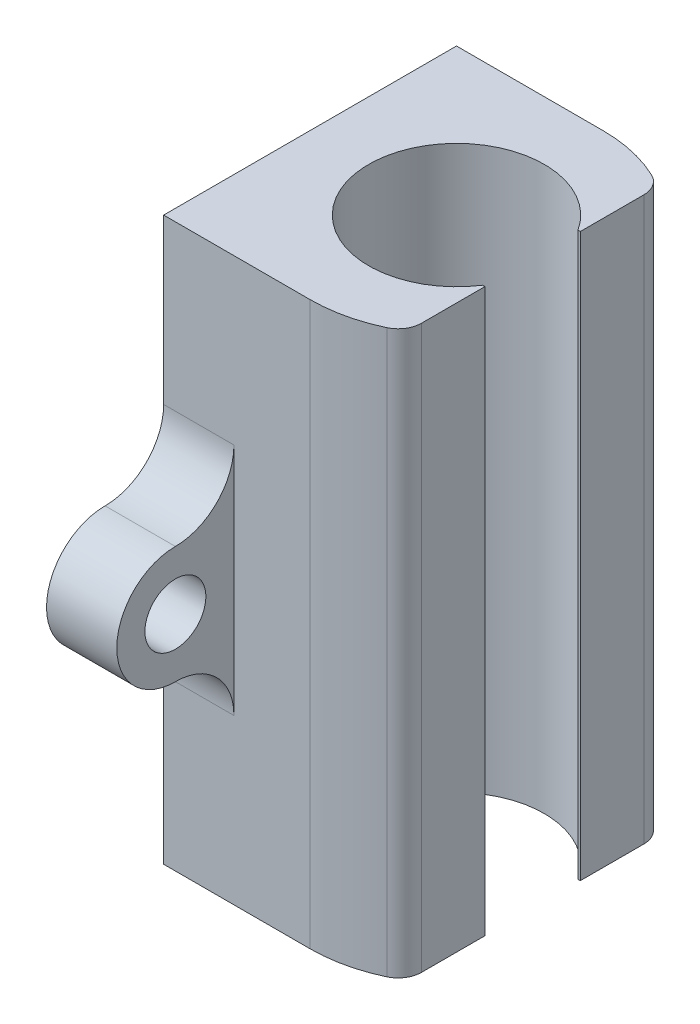
ISO-10303-21;
HEADER;
FILE_DESCRIPTION(('STEP AP214'),'2;1');
FILE_NAME('part.step','',(''),(''),'','','');
FILE_SCHEMA(('AUTOMOTIVE_DESIGN { 1 0 10303 214 1 1 1 1 }'));
ENDSEC;
DATA;
#1=APPLICATION_CONTEXT('core data for automotive mechanical design processes');
#2=APPLICATION_PROTOCOL_DEFINITION('international standard','automotive_design',2000,#1);
#3=PRODUCT_CONTEXT('',#1,'mechanical');
#4=PRODUCT('Part','Part','',(#3));
#5=PRODUCT_RELATED_PRODUCT_CATEGORY('part','',(#4));
#6=PRODUCT_DEFINITION_FORMATION('','',#4);
#7=PRODUCT_DEFINITION_CONTEXT('part definition',#1,'design');
#8=PRODUCT_DEFINITION('design','',#6,#7);
#9=PRODUCT_DEFINITION_SHAPE('','',#8);
#10=(LENGTH_UNIT() NAMED_UNIT(*) SI_UNIT(.MILLI.,.METRE.));
#11=(NAMED_UNIT(*) PLANE_ANGLE_UNIT() SI_UNIT($,.RADIAN.));
#12=(NAMED_UNIT(*) SI_UNIT($,.STERADIAN.) SOLID_ANGLE_UNIT());
#13=UNCERTAINTY_MEASURE_WITH_UNIT(LENGTH_MEASURE(1.E-05),#10,'distance_accuracy_value','');
#14=(GEOMETRIC_REPRESENTATION_CONTEXT(3) GLOBAL_UNCERTAINTY_ASSIGNED_CONTEXT((#13)) GLOBAL_UNIT_ASSIGNED_CONTEXT((#10,
#11,#12)) REPRESENTATION_CONTEXT('',''));
#15=CARTESIAN_POINT('',(0.,0.,0.));
#16=DIRECTION('',(0.,0.,1.));
#17=DIRECTION('',(1.,0.,0.));
#18=AXIS2_PLACEMENT_3D('',#15,#16,#17);
#19=CARTESIAN_POINT('',(0.,48.,0.));
#20=DIRECTION('',(0.,-1.,0.));
#21=DIRECTION('',(0.,0.,-1.));
#22=AXIS2_PLACEMENT_3D('',#19,#20,#21);
#23=CYLINDRICAL_SURFACE('',#22,12.5);
#24=CARTESIAN_POINT('',(0.,48.,0.));
#25=DIRECTION('',(0.,1.,0.));
#26=DIRECTION('',(0.,0.,1.));
#27=AXIS2_PLACEMENT_3D('',#24,#25,#26);
#28=CIRCLE('',#27,12.5);
#29=CARTESIAN_POINT('',(5.35714285714286,48.,-11.2938487863156));
#30=VERTEX_POINT('',#29);
#31=CARTESIAN_POINT('',(0.,48.,-12.5));
#32=VERTEX_POINT('',#31);
#33=EDGE_CURVE('E261',#30,#32,#28,.T.);
#34=ORIENTED_EDGE('',*,*,#33,.F.);
#35=DIRECTION('',(0.,-1.,0.));
#36=VECTOR('',#35,1.);
#37=CARTESIAN_POINT('',(5.35714285714286,48.,-11.2938487863156));
#38=LINE('',#37,#36);
#39=CARTESIAN_POINT('',(5.35714285714286,0.,-11.2938487863156));
#40=VERTEX_POINT('',#39);
#41=EDGE_CURVE('E330',#30,#40,#38,.T.);
#42=ORIENTED_EDGE('',*,*,#41,.T.);
#43=CARTESIAN_POINT('',(0.,0.,0.));
#44=DIRECTION('',(0.,1.,0.));
#45=DIRECTION('',(0.,0.,1.));
#46=AXIS2_PLACEMENT_3D('',#43,#44,#45);
#47=CIRCLE('',#46,12.5);
#48=CARTESIAN_POINT('',(0.,0.,-12.5));
#49=VERTEX_POINT('',#48);
#50=EDGE_CURVE('E255',#40,#49,#47,.T.);
#51=ORIENTED_EDGE('',*,*,#50,.T.);
#52=DIRECTION('',(0.,-1.,0.));
#53=VECTOR('',#52,1.);
#54=CARTESIAN_POINT('',(0.,48.,-12.5));
#55=LINE('',#54,#53);
#56=EDGE_CURVE('E289',#32,#49,#55,.T.);
#57=ORIENTED_EDGE('',*,*,#56,.F.);
#58=EDGE_LOOP('',(#34,#42,#51,#57));
#59=FACE_BOUND('',#58,.T.);
#60=ADVANCED_FACE('F32',(#59),#23,.T.);
#61=CARTESIAN_POINT('',(0.,48.,0.));
#62=DIRECTION('',(0.,1.,0.));
#63=DIRECTION('',(0.,0.,1.));
#64=AXIS2_PLACEMENT_3D('',#61,#62,#63);
#65=PLANE('',#64);
#66=DIRECTION('',(0.,0.,-1.));
#67=VECTOR('',#66,1.);
#68=CARTESIAN_POINT('',(6.5,48.,-4.06939798987516));
#69=LINE('',#68,#67);
#70=CARTESIAN_POINT('',(6.5,48.,-4.06939798987516));
#71=VERTEX_POINT('',#70);
#72=CARTESIAN_POINT('',(6.5,48.,-9.48683298050514));
#73=VERTEX_POINT('',#72);
#74=EDGE_CURVE('E190',#71,#73,#69,.T.);
#75=ORIENTED_EDGE('',*,*,#74,.T.);
#76=CARTESIAN_POINT('',(4.5,48.,-9.48683298050514));
#77=DIRECTION('',(0.,1.,0.));
#78=DIRECTION('',(0.,0.,1.));
#79=AXIS2_PLACEMENT_3D('',#76,#77,#78);
#80=CIRCLE('',#79,2.);
#81=EDGE_CURVE('E11',#73,#30,#80,.T.);
#82=ORIENTED_EDGE('',*,*,#81,.T.);
#83=ORIENTED_EDGE('',*,*,#33,.T.);
#84=DIRECTION('',(-1.,0.,0.));
#85=VECTOR('',#84,1.);
#86=CARTESIAN_POINT('',(0.,48.,-12.5));
#87=LINE('',#86,#85);
#88=CARTESIAN_POINT('',(-12.5,48.,-12.5));
#89=VERTEX_POINT('',#88);
#90=EDGE_CURVE('E260',#32,#89,#87,.T.);
#91=ORIENTED_EDGE('',*,*,#90,.T.);
#92=DIRECTION('',(0.,0.,1.));
#93=VECTOR('',#92,1.);
#94=CARTESIAN_POINT('',(-12.5,48.,-12.5));
#95=LINE('',#94,#93);
#96=CARTESIAN_POINT('',(-12.5,48.,12.5));
#97=VERTEX_POINT('',#96);
#98=EDGE_CURVE('E263',#89,#97,#95,.T.);
#99=ORIENTED_EDGE('',*,*,#98,.T.);
#100=DIRECTION('',(1.,0.,0.));
#101=VECTOR('',#100,1.);
#102=CARTESIAN_POINT('',(0.,48.,12.5));
#103=LINE('',#102,#101);
#104=CARTESIAN_POINT('',(0.,48.,12.5));
#105=VERTEX_POINT('',#104);
#106=EDGE_CURVE('E265',#97,#105,#103,.T.);
#107=ORIENTED_EDGE('',*,*,#106,.T.);
#108=CARTESIAN_POINT('',(5.35714285714286,48.,11.2938487863156));
#109=VERTEX_POINT('',#108);
#110=EDGE_CURVE('E258',#105,#109,#28,.T.);
#111=ORIENTED_EDGE('',*,*,#110,.T.);
#112=CARTESIAN_POINT('',(4.5,48.,9.48683298050514));
#113=DIRECTION('',(0.,1.,0.));
#114=DIRECTION('',(0.,0.,1.));
#115=AXIS2_PLACEMENT_3D('',#112,#113,#114);
#116=CIRCLE('',#115,2.);
#117=CARTESIAN_POINT('',(6.5,48.,9.48683298050514));
#118=VERTEX_POINT('',#117);
#119=EDGE_CURVE('E177',#109,#118,#116,.T.);
#120=ORIENTED_EDGE('',*,*,#119,.T.);
#121=DIRECTION('',(0.,0.,-1.));
#122=VECTOR('',#121,1.);
#123=CARTESIAN_POINT('',(6.5,48.,12.5));
#124=LINE('',#123,#122);
#125=CARTESIAN_POINT('',(6.5,48.,4.06939798987516));
#126=VERTEX_POINT('',#125);
#127=EDGE_CURVE('E169',#118,#126,#124,.T.);
#128=ORIENTED_EDGE('',*,*,#127,.T.);
#129=DIRECTION('',(-1.,0.,0.));
#130=VECTOR('',#129,1.);
#131=CARTESIAN_POINT('',(6.5,48.,4.06939798987516));
#132=LINE('',#131,#130);
#133=CARTESIAN_POINT('',(6.3,48.,4.06939798987516));
#134=VERTEX_POINT('',#133);
#135=EDGE_CURVE('E174',#126,#134,#132,.T.);
#136=ORIENTED_EDGE('',*,*,#135,.T.);
#137=CARTESIAN_POINT('',(0.,48.,0.));
#138=DIRECTION('',(0.,1.,0.));
#139=DIRECTION('',(0.,0.,1.));
#140=AXIS2_PLACEMENT_3D('',#137,#138,#139);
#141=CIRCLE('',#140,7.5);
#142=CARTESIAN_POINT('',(6.3,48.,-4.06939798987516));
#143=VERTEX_POINT('',#142);
#144=EDGE_CURVE('E253',#143,#134,#141,.T.);
#145=ORIENTED_EDGE('',*,*,#144,.F.);
#146=DIRECTION('',(1.,0.,0.));
#147=VECTOR('',#146,1.);
#148=CARTESIAN_POINT('',(6.5,48.,-4.06939798987516));
#149=LINE('',#148,#147);
#150=EDGE_CURVE('E194',#143,#71,#149,.T.);
#151=ORIENTED_EDGE('',*,*,#150,.T.);
#152=EDGE_LOOP('',(#75,#82,#83,#91,#99,#107,#111,#120,#128,#136,#145,#151));
#153=FACE_BOUND('',#152,.T.);
#154=ADVANCED_FACE('F171',(#153),#65,.T.);
#155=CARTESIAN_POINT('',(0.,0.,0.));
#156=DIRECTION('',(0.,1.,0.));
#157=DIRECTION('',(0.,0.,1.));
#158=AXIS2_PLACEMENT_3D('',#155,#156,#157);
#159=PLANE('',#158);
#160=ORIENTED_EDGE('',*,*,#50,.F.);
#161=CARTESIAN_POINT('',(4.5,0.,-9.48683298050514));
#162=DIRECTION('',(0.,1.,0.));
#163=DIRECTION('',(0.,0.,1.));
#164=AXIS2_PLACEMENT_3D('',#161,#162,#163);
#165=CIRCLE('',#164,2.);
#166=CARTESIAN_POINT('',(6.5,0.,-9.48683298050514));
#167=VERTEX_POINT('',#166);
#168=EDGE_CURVE('E54',#40,#167,#165,.F.);
#169=ORIENTED_EDGE('',*,*,#168,.T.);
#170=DIRECTION('',(0.,0.,-1.));
#171=VECTOR('',#170,1.);
#172=CARTESIAN_POINT('',(6.5,0.,-4.06939798987516));
#173=LINE('',#172,#171);
#174=CARTESIAN_POINT('',(6.5,0.,-4.06939798987516));
#175=VERTEX_POINT('',#174);
#176=EDGE_CURVE('E180',#175,#167,#173,.T.);
#177=ORIENTED_EDGE('',*,*,#176,.F.);
#178=DIRECTION('',(1.,0.,0.));
#179=VECTOR('',#178,1.);
#180=CARTESIAN_POINT('',(6.5,0.,-4.06939798987516));
#181=LINE('',#180,#179);
#182=CARTESIAN_POINT('',(6.3,0.,-4.06939798987516));
#183=VERTEX_POINT('',#182);
#184=EDGE_CURVE('E203',#183,#175,#181,.T.);
#185=ORIENTED_EDGE('',*,*,#184,.F.);
#186=CARTESIAN_POINT('',(0.,0.,0.));
#187=DIRECTION('',(0.,1.,0.));
#188=DIRECTION('',(0.,0.,1.));
#189=AXIS2_PLACEMENT_3D('',#186,#187,#188);
#190=CIRCLE('',#189,7.5);
#191=CARTESIAN_POINT('',(6.3,0.,4.06939798987516));
#192=VERTEX_POINT('',#191);
#193=EDGE_CURVE('E250',#183,#192,#190,.T.);
#194=ORIENTED_EDGE('',*,*,#193,.T.);
#195=DIRECTION('',(-1.,0.,0.));
#196=VECTOR('',#195,1.);
#197=CARTESIAN_POINT('',(6.5,0.,4.06939798987516));
#198=LINE('',#197,#196);
#199=CARTESIAN_POINT('',(6.5,0.,4.06939798987516));
#200=VERTEX_POINT('',#199);
#201=EDGE_CURVE('E201',#200,#192,#198,.T.);
#202=ORIENTED_EDGE('',*,*,#201,.F.);
#203=DIRECTION('',(0.,0.,-1.));
#204=VECTOR('',#203,1.);
#205=CARTESIAN_POINT('',(6.5,0.,12.5));
#206=LINE('',#205,#204);
#207=CARTESIAN_POINT('',(6.5,0.,9.48683298050514));
#208=VERTEX_POINT('',#207);
#209=EDGE_CURVE('E186',#208,#200,#206,.T.);
#210=ORIENTED_EDGE('',*,*,#209,.F.);
#211=CARTESIAN_POINT('',(4.5,0.,9.48683298050514));
#212=DIRECTION('',(0.,1.,0.));
#213=DIRECTION('',(0.,0.,1.));
#214=AXIS2_PLACEMENT_3D('',#211,#212,#213);
#215=CIRCLE('',#214,2.);
#216=CARTESIAN_POINT('',(5.35714285714286,0.,11.2938487863156));
#217=VERTEX_POINT('',#216);
#218=EDGE_CURVE('E328',#208,#217,#215,.F.);
#219=ORIENTED_EDGE('',*,*,#218,.T.);
#220=CARTESIAN_POINT('',(0.,0.,12.5));
#221=VERTEX_POINT('',#220);
#222=EDGE_CURVE('E268',#221,#217,#47,.T.);
#223=ORIENTED_EDGE('',*,*,#222,.F.);
#224=DIRECTION('',(1.,0.,0.));
#225=VECTOR('',#224,1.);
#226=CARTESIAN_POINT('',(0.,0.,12.5));
#227=LINE('',#226,#225);
#228=CARTESIAN_POINT('',(-12.5,0.,12.5));
#229=VERTEX_POINT('',#228);
#230=EDGE_CURVE('E277',#229,#221,#227,.T.);
#231=ORIENTED_EDGE('',*,*,#230,.F.);
#232=DIRECTION('',(0.,0.,1.));
#233=VECTOR('',#232,1.);
#234=CARTESIAN_POINT('',(-12.5,0.,-12.5));
#235=LINE('',#234,#233);
#236=CARTESIAN_POINT('',(-12.5,0.,-12.5));
#237=VERTEX_POINT('',#236);
#238=EDGE_CURVE('E274',#237,#229,#235,.T.);
#239=ORIENTED_EDGE('',*,*,#238,.F.);
#240=DIRECTION('',(-1.,0.,0.));
#241=VECTOR('',#240,1.);
#242=CARTESIAN_POINT('',(0.,0.,-12.5));
#243=LINE('',#242,#241);
#244=EDGE_CURVE('E271',#49,#237,#243,.T.);
#245=ORIENTED_EDGE('',*,*,#244,.F.);
#246=EDGE_LOOP('',(#160,#169,#177,#185,#194,#202,#210,#219,#223,#231,#239,#245));
#247=FACE_BOUND('',#246,.T.);
#248=ADVANCED_FACE('F340',(#247),#159,.F.);
#249=ORIENTED_EDGE('',*,*,#222,.T.);
#250=DIRECTION('',(0.,-1.,0.));
#251=VECTOR('',#250,1.);
#252=CARTESIAN_POINT('',(5.35714285714286,48.,11.2938487863156));
#253=LINE('',#252,#251);
#254=EDGE_CURVE('E322',#217,#109,#253,.F.);
#255=ORIENTED_EDGE('',*,*,#254,.T.);
#256=ORIENTED_EDGE('',*,*,#110,.F.);
#257=DIRECTION('',(0.,-1.,0.));
#258=VECTOR('',#257,1.);
#259=CARTESIAN_POINT('',(0.,48.,12.5));
#260=LINE('',#259,#258);
#261=EDGE_CURVE('E267',#105,#221,#260,.T.);
#262=ORIENTED_EDGE('',*,*,#261,.T.);
#263=EDGE_LOOP('',(#249,#255,#256,#262));
#264=FACE_BOUND('',#263,.T.);
#265=ADVANCED_FACE('F359',(#264),#23,.T.);
#266=CARTESIAN_POINT('',(0.,48.,-12.5));
#267=DIRECTION('',(0.,0.,1.));
#268=DIRECTION('',(1.,0.,0.));
#269=AXIS2_PLACEMENT_3D('',#266,#267,#268);
#270=PLANE('',#269);
#271=DIRECTION('',(0.,1.,0.));
#272=VECTOR('',#271,1.);
#273=CARTESIAN_POINT('',(-6.5,19.,-12.5));
#274=LINE('',#273,#272);
#275=CARTESIAN_POINT('',(-6.5,14.,-12.5));
#276=VERTEX_POINT('',#275);
#277=CARTESIAN_POINT('',(-6.5,34.,-12.5));
#278=VERTEX_POINT('',#277);
#279=EDGE_CURVE('E242',#276,#278,#274,.T.);
#280=ORIENTED_EDGE('',*,*,#279,.T.);
#281=DIRECTION('',(-1.,0.,0.));
#282=VECTOR('',#281,1.);
#283=CARTESIAN_POINT('',(0.,34.,-12.5));
#284=LINE('',#283,#282);
#285=CARTESIAN_POINT('',(-12.5,34.,-12.5));
#286=VERTEX_POINT('',#285);
#287=EDGE_CURVE('E305',#278,#286,#284,.T.);
#288=ORIENTED_EDGE('',*,*,#287,.T.);
#289=DIRECTION('',(0.,-1.,0.));
#290=VECTOR('',#289,1.);
#291=CARTESIAN_POINT('',(-12.5,48.,-12.5));
#292=LINE('',#291,#290);
#293=EDGE_CURVE('E286',#89,#286,#292,.T.);
#294=ORIENTED_EDGE('',*,*,#293,.F.);
#295=ORIENTED_EDGE('',*,*,#90,.F.);
#296=ORIENTED_EDGE('',*,*,#56,.T.);
#297=ORIENTED_EDGE('',*,*,#244,.T.);
#298=CARTESIAN_POINT('',(-12.5,14.,-12.5));
#299=VERTEX_POINT('',#298);
#300=EDGE_CURVE('E285',#299,#237,#292,.T.);
#301=ORIENTED_EDGE('',*,*,#300,.F.);
#302=DIRECTION('',(-1.,0.,0.));
#303=VECTOR('',#302,1.);
#304=CARTESIAN_POINT('',(0.,14.,-12.5));
#305=LINE('',#304,#303);
#306=EDGE_CURVE('E292',#299,#276,#305,.F.);
#307=ORIENTED_EDGE('',*,*,#306,.T.);
#308=EDGE_LOOP('',(#280,#288,#294,#295,#296,#297,#301,#307));
#309=FACE_BOUND('',#308,.T.);
#310=ADVANCED_FACE('F346',(#309),#270,.F.);
#311=CARTESIAN_POINT('',(-12.5,48.,-12.5));
#312=DIRECTION('',(1.,0.,0.));
#313=DIRECTION('',(0.,0.,-1.));
#314=AXIS2_PLACEMENT_3D('',#311,#312,#313);
#315=PLANE('',#314);
#316=CARTESIAN_POINT('',(-12.5,24.,17.5));
#317=DIRECTION('',(-1.,0.,0.));
#318=DIRECTION('',(0.,0.,1.));
#319=AXIS2_PLACEMENT_3D('',#316,#317,#318);
#320=CIRCLE('',#319,2.6);
#321=CARTESIAN_POINT('',(-12.5,24.,20.1));
#322=VERTEX_POINT('',#321);
#323=EDGE_CURVE('E209',#322,#322,#320,.T.);
#324=ORIENTED_EDGE('',*,*,#323,.F.);
#325=EDGE_LOOP('',(#324));
#326=FACE_BOUND('',#325,.T.);
#327=CARTESIAN_POINT('',(-12.5,24.,-17.5));
#328=DIRECTION('',(-1.,0.,0.));
#329=DIRECTION('',(0.,0.,1.));
#330=AXIS2_PLACEMENT_3D('',#327,#328,#329);
#331=CIRCLE('',#330,2.6);
#332=CARTESIAN_POINT('',(-12.5,24.,-14.9));
#333=VERTEX_POINT('',#332);
#334=EDGE_CURVE('E216',#333,#333,#331,.T.);
#335=ORIENTED_EDGE('',*,*,#334,.F.);
#336=EDGE_LOOP('',(#335));
#337=FACE_BOUND('',#336,.T.);
#338=ORIENTED_EDGE('',*,*,#238,.T.);
#339=DIRECTION('',(0.,-1.,0.));
#340=VECTOR('',#339,1.);
#341=CARTESIAN_POINT('',(-12.5,48.,12.5));
#342=LINE('',#341,#340);
#343=CARTESIAN_POINT('',(-12.5,14.,12.5));
#344=VERTEX_POINT('',#343);
#345=EDGE_CURVE('E281',#344,#229,#342,.T.);
#346=ORIENTED_EDGE('',*,*,#345,.F.);
#347=CARTESIAN_POINT('',(-12.5,14.,17.5));
#348=DIRECTION('',(1.,0.,0.));
#349=DIRECTION('',(0.,0.,-1.));
#350=AXIS2_PLACEMENT_3D('',#347,#348,#349);
#351=CIRCLE('',#350,5.);
#352=CARTESIAN_POINT('',(-12.5,19.,17.5));
#353=VERTEX_POINT('',#352);
#354=EDGE_CURVE('E308',#344,#353,#351,.T.);
#355=ORIENTED_EDGE('',*,*,#354,.T.);
#356=CARTESIAN_POINT('',(-12.5,24.,17.5));
#357=DIRECTION('',(-1.,0.,0.));
#358=DIRECTION('',(0.,0.,1.));
#359=AXIS2_PLACEMENT_3D('',#356,#357,#358);
#360=CIRCLE('',#359,5.);
#361=CARTESIAN_POINT('',(-12.5,29.,17.5));
#362=VERTEX_POINT('',#361);
#363=EDGE_CURVE('E222',#353,#362,#360,.T.);
#364=ORIENTED_EDGE('',*,*,#363,.T.);
#365=CARTESIAN_POINT('',(-12.5,34.,17.5));
#366=DIRECTION('',(1.,0.,0.));
#367=DIRECTION('',(0.,0.,-1.));
#368=AXIS2_PLACEMENT_3D('',#365,#366,#367);
#369=CIRCLE('',#368,5.);
#370=CARTESIAN_POINT('',(-12.5,34.,12.5));
#371=VERTEX_POINT('',#370);
#372=EDGE_CURVE('E313',#362,#371,#369,.T.);
#373=ORIENTED_EDGE('',*,*,#372,.T.);
#374=EDGE_CURVE('E282',#97,#371,#342,.T.);
#375=ORIENTED_EDGE('',*,*,#374,.F.);
#376=ORIENTED_EDGE('',*,*,#98,.F.);
#377=ORIENTED_EDGE('',*,*,#293,.T.);
#378=CARTESIAN_POINT('',(-12.5,34.,-17.5));
#379=DIRECTION('',(1.,0.,0.));
#380=DIRECTION('',(0.,0.,-1.));
#381=AXIS2_PLACEMENT_3D('',#378,#379,#380);
#382=CIRCLE('',#381,5.);
#383=CARTESIAN_POINT('',(-12.5,29.,-17.5));
#384=VERTEX_POINT('',#383);
#385=EDGE_CURVE('E317',#286,#384,#382,.T.);
#386=ORIENTED_EDGE('',*,*,#385,.T.);
#387=CARTESIAN_POINT('',(-12.5,24.,-17.5));
#388=DIRECTION('',(-1.,0.,0.));
#389=DIRECTION('',(0.,0.,1.));
#390=AXIS2_PLACEMENT_3D('',#387,#388,#389);
#391=CIRCLE('',#390,5.);
#392=CARTESIAN_POINT('',(-12.5,19.,-17.5));
#393=VERTEX_POINT('',#392);
#394=EDGE_CURVE('E236',#384,#393,#391,.T.);
#395=ORIENTED_EDGE('',*,*,#394,.T.);
#396=CARTESIAN_POINT('',(-12.5,14.,-17.5));
#397=DIRECTION('',(1.,0.,0.));
#398=DIRECTION('',(0.,0.,-1.));
#399=AXIS2_PLACEMENT_3D('',#396,#397,#398);
#400=CIRCLE('',#399,5.);
#401=EDGE_CURVE('E295',#393,#299,#400,.T.);
#402=ORIENTED_EDGE('',*,*,#401,.T.);
#403=ORIENTED_EDGE('',*,*,#300,.T.);
#404=EDGE_LOOP('',(#338,#346,#355,#364,#373,#375,#376,#377,#386,#395,#402,#403));
#405=FACE_BOUND('',#404,.T.);
#406=ADVANCED_FACE('F372',(#326,#337,#405),#315,.F.);
#407=CARTESIAN_POINT('',(0.,48.,12.5));
#408=DIRECTION('',(0.,0.,-1.));
#409=DIRECTION('',(-1.,0.,0.));
#410=AXIS2_PLACEMENT_3D('',#407,#408,#409);
#411=PLANE('',#410);
#412=DIRECTION('',(0.,-1.,0.));
#413=VECTOR('',#412,1.);
#414=CARTESIAN_POINT('',(-6.5,29.,12.5));
#415=LINE('',#414,#413);
#416=CARTESIAN_POINT('',(-6.5,34.,12.5));
#417=VERTEX_POINT('',#416);
#418=CARTESIAN_POINT('',(-6.5,14.,12.5));
#419=VERTEX_POINT('',#418);
#420=EDGE_CURVE('E228',#417,#419,#415,.T.);
#421=ORIENTED_EDGE('',*,*,#420,.T.);
#422=DIRECTION('',(-1.,0.,0.));
#423=VECTOR('',#422,1.);
#424=CARTESIAN_POINT('',(0.,14.,12.5));
#425=LINE('',#424,#423);
#426=EDGE_CURVE('E302',#419,#344,#425,.T.);
#427=ORIENTED_EDGE('',*,*,#426,.T.);
#428=ORIENTED_EDGE('',*,*,#345,.T.);
#429=ORIENTED_EDGE('',*,*,#230,.T.);
#430=ORIENTED_EDGE('',*,*,#261,.F.);
#431=ORIENTED_EDGE('',*,*,#106,.F.);
#432=ORIENTED_EDGE('',*,*,#374,.T.);
#433=DIRECTION('',(-1.,0.,0.));
#434=VECTOR('',#433,1.);
#435=CARTESIAN_POINT('',(0.,34.,12.5));
#436=LINE('',#435,#434);
#437=EDGE_CURVE('E299',#371,#417,#436,.F.);
#438=ORIENTED_EDGE('',*,*,#437,.T.);
#439=EDGE_LOOP('',(#421,#427,#428,#429,#430,#431,#432,#438));
#440=FACE_BOUND('',#439,.T.);
#441=ADVANCED_FACE('F424',(#440),#411,.F.);
#442=CARTESIAN_POINT('',(0.,48.,0.));
#443=DIRECTION('',(0.,-1.,0.));
#444=DIRECTION('',(0.,0.,-1.));
#445=AXIS2_PLACEMENT_3D('',#442,#443,#444);
#446=CYLINDRICAL_SURFACE('',#445,7.5);
#447=DIRECTION('',(0.,-1.,0.));
#448=VECTOR('',#447,1.);
#449=CARTESIAN_POINT('',(6.3,48.,-4.06939798987516));
#450=LINE('',#449,#448);
#451=EDGE_CURVE('E210',#143,#183,#450,.T.);
#452=ORIENTED_EDGE('',*,*,#451,.F.);
#453=ORIENTED_EDGE('',*,*,#144,.T.);
#454=DIRECTION('',(0.,-1.,0.));
#455=VECTOR('',#454,1.);
#456=CARTESIAN_POINT('',(6.3,48.,4.06939798987516));
#457=LINE('',#456,#455);
#458=EDGE_CURVE('E189',#134,#192,#457,.T.);
#459=ORIENTED_EDGE('',*,*,#458,.T.);
#460=ORIENTED_EDGE('',*,*,#193,.F.);
#461=EDGE_LOOP('',(#452,#453,#459,#460));
#462=FACE_BOUND('',#461,.T.);
#463=ADVANCED_FACE('F383',(#462),#446,.F.);
#464=CARTESIAN_POINT('',(-6.5,24.,-17.5));
#465=DIRECTION('',(-1.,0.,0.));
#466=DIRECTION('',(0.,0.,1.));
#467=AXIS2_PLACEMENT_3D('',#464,#465,#466);
#468=CYLINDRICAL_SURFACE('',#467,5.);
#469=ORIENTED_EDGE('',*,*,#394,.F.);
#470=DIRECTION('',(-1.,0.,0.));
#471=VECTOR('',#470,1.);
#472=CARTESIAN_POINT('',(-6.5,29.,-17.5));
#473=LINE('',#472,#471);
#474=CARTESIAN_POINT('',(-6.5,29.,-17.5));
#475=VERTEX_POINT('',#474);
#476=EDGE_CURVE('E247',#475,#384,#473,.T.);
#477=ORIENTED_EDGE('',*,*,#476,.F.);
#478=CARTESIAN_POINT('',(-6.5,24.,-17.5));
#479=DIRECTION('',(-1.,0.,0.));
#480=DIRECTION('',(0.,0.,1.));
#481=AXIS2_PLACEMENT_3D('',#478,#479,#480);
#482=CIRCLE('',#481,5.);
#483=CARTESIAN_POINT('',(-6.5,19.,-17.5));
#484=VERTEX_POINT('',#483);
#485=EDGE_CURVE('E239',#475,#484,#482,.T.);
#486=ORIENTED_EDGE('',*,*,#485,.T.);
#487=DIRECTION('',(-1.,0.,0.));
#488=VECTOR('',#487,1.);
#489=CARTESIAN_POINT('',(-6.5,19.,-17.5));
#490=LINE('',#489,#488);
#491=EDGE_CURVE('E244',#484,#393,#490,.T.);
#492=ORIENTED_EDGE('',*,*,#491,.T.);
#493=EDGE_LOOP('',(#469,#477,#486,#492));
#494=FACE_BOUND('',#493,.T.);
#495=ADVANCED_FACE('F418',(#494),#468,.T.);
#496=CARTESIAN_POINT('',(-6.5,24.,-17.5));
#497=DIRECTION('',(-1.,0.,0.));
#498=DIRECTION('',(0.,0.,1.));
#499=AXIS2_PLACEMENT_3D('',#496,#497,#498);
#500=PLANE('',#499);
#501=CARTESIAN_POINT('',(-6.5,24.,-17.5));
#502=DIRECTION('',(-1.,0.,0.));
#503=DIRECTION('',(0.,0.,1.));
#504=AXIS2_PLACEMENT_3D('',#501,#502,#503);
#505=CIRCLE('',#504,2.6);
#506=CARTESIAN_POINT('',(-6.5,24.,-14.9));
#507=VERTEX_POINT('',#506);
#508=EDGE_CURVE('E219',#507,#507,#505,.T.);
#509=ORIENTED_EDGE('',*,*,#508,.T.);
#510=EDGE_LOOP('',(#509));
#511=FACE_BOUND('',#510,.T.);
#512=ORIENTED_EDGE('',*,*,#485,.F.);
#513=CARTESIAN_POINT('',(-6.5,34.,-17.5));
#514=DIRECTION('',(-1.,0.,0.));
#515=DIRECTION('',(0.,0.,1.));
#516=AXIS2_PLACEMENT_3D('',#513,#514,#515);
#517=CIRCLE('',#516,5.);
#518=EDGE_CURVE('E319',#475,#278,#517,.T.);
#519=ORIENTED_EDGE('',*,*,#518,.T.);
#520=ORIENTED_EDGE('',*,*,#279,.F.);
#521=CARTESIAN_POINT('',(-6.5,14.,-17.5));
#522=DIRECTION('',(-1.,0.,0.));
#523=DIRECTION('',(0.,0.,1.));
#524=AXIS2_PLACEMENT_3D('',#521,#522,#523);
#525=CIRCLE('',#524,5.);
#526=EDGE_CURVE('E297',#276,#484,#525,.T.);
#527=ORIENTED_EDGE('',*,*,#526,.T.);
#528=EDGE_LOOP('',(#512,#519,#520,#527));
#529=FACE_BOUND('',#528,.T.);
#530=ADVANCED_FACE('F414',(#511,#529),#500,.F.);
#531=CARTESIAN_POINT('',(-6.5,24.,17.5));
#532=DIRECTION('',(-1.,0.,0.));
#533=DIRECTION('',(0.,0.,1.));
#534=AXIS2_PLACEMENT_3D('',#531,#532,#533);
#535=CYLINDRICAL_SURFACE('',#534,5.);
#536=ORIENTED_EDGE('',*,*,#363,.F.);
#537=DIRECTION('',(-1.,0.,0.));
#538=VECTOR('',#537,1.);
#539=CARTESIAN_POINT('',(-6.5,19.,17.5));
#540=LINE('',#539,#538);
#541=CARTESIAN_POINT('',(-6.5,19.,17.5));
#542=VERTEX_POINT('',#541);
#543=EDGE_CURVE('E233',#542,#353,#540,.T.);
#544=ORIENTED_EDGE('',*,*,#543,.F.);
#545=CARTESIAN_POINT('',(-6.5,24.,17.5));
#546=DIRECTION('',(-1.,0.,0.));
#547=DIRECTION('',(0.,0.,1.));
#548=AXIS2_PLACEMENT_3D('',#545,#546,#547);
#549=CIRCLE('',#548,5.);
#550=CARTESIAN_POINT('',(-6.5,29.,17.5));
#551=VERTEX_POINT('',#550);
#552=EDGE_CURVE('E225',#542,#551,#549,.T.);
#553=ORIENTED_EDGE('',*,*,#552,.T.);
#554=DIRECTION('',(-1.,0.,0.));
#555=VECTOR('',#554,1.);
#556=CARTESIAN_POINT('',(-6.5,29.,17.5));
#557=LINE('',#556,#555);
#558=EDGE_CURVE('E230',#551,#362,#557,.T.);
#559=ORIENTED_EDGE('',*,*,#558,.T.);
#560=EDGE_LOOP('',(#536,#544,#553,#559));
#561=FACE_BOUND('',#560,.T.);
#562=ADVANCED_FACE('F410',(#561),#535,.T.);
#563=CARTESIAN_POINT('',(-6.5,24.,17.5));
#564=DIRECTION('',(-1.,0.,0.));
#565=DIRECTION('',(0.,0.,1.));
#566=AXIS2_PLACEMENT_3D('',#563,#564,#565);
#567=PLANE('',#566);
#568=CARTESIAN_POINT('',(-6.5,24.,17.5));
#569=DIRECTION('',(-1.,0.,0.));
#570=DIRECTION('',(0.,0.,1.));
#571=AXIS2_PLACEMENT_3D('',#568,#569,#570);
#572=CIRCLE('',#571,2.6);
#573=CARTESIAN_POINT('',(-6.5,24.,20.1));
#574=VERTEX_POINT('',#573);
#575=EDGE_CURVE('E213',#574,#574,#572,.T.);
#576=ORIENTED_EDGE('',*,*,#575,.T.);
#577=EDGE_LOOP('',(#576));
#578=FACE_BOUND('',#577,.T.);
#579=ORIENTED_EDGE('',*,*,#552,.F.);
#580=CARTESIAN_POINT('',(-6.5,14.,17.5));
#581=DIRECTION('',(-1.,0.,0.));
#582=DIRECTION('',(0.,0.,1.));
#583=AXIS2_PLACEMENT_3D('',#580,#581,#582);
#584=CIRCLE('',#583,5.);
#585=EDGE_CURVE('E310',#542,#419,#584,.T.);
#586=ORIENTED_EDGE('',*,*,#585,.T.);
#587=ORIENTED_EDGE('',*,*,#420,.F.);
#588=CARTESIAN_POINT('',(-6.5,34.,17.5));
#589=DIRECTION('',(-1.,0.,0.));
#590=DIRECTION('',(0.,0.,1.));
#591=AXIS2_PLACEMENT_3D('',#588,#589,#590);
#592=CIRCLE('',#591,5.);
#593=EDGE_CURVE('E315',#417,#551,#592,.T.);
#594=ORIENTED_EDGE('',*,*,#593,.T.);
#595=EDGE_LOOP('',(#579,#586,#587,#594));
#596=FACE_BOUND('',#595,.T.);
#597=ADVANCED_FACE('F406',(#578,#596),#567,.F.);
#598=CARTESIAN_POINT('',(-6.5,24.,-17.5));
#599=DIRECTION('',(-1.,0.,0.));
#600=DIRECTION('',(0.,0.,1.));
#601=AXIS2_PLACEMENT_3D('',#598,#599,#600);
#602=CYLINDRICAL_SURFACE('',#601,2.6);
#603=ORIENTED_EDGE('',*,*,#508,.F.);
#604=EDGE_LOOP('',(#603));
#605=FACE_BOUND('',#604,.T.);
#606=ORIENTED_EDGE('',*,*,#334,.T.);
#607=EDGE_LOOP('',(#606));
#608=FACE_BOUND('',#607,.T.);
#609=ADVANCED_FACE('F402',(#605,#608),#602,.F.);
#610=CARTESIAN_POINT('',(-6.5,24.,17.5));
#611=DIRECTION('',(-1.,0.,0.));
#612=DIRECTION('',(0.,0.,1.));
#613=AXIS2_PLACEMENT_3D('',#610,#611,#612);
#614=CYLINDRICAL_SURFACE('',#613,2.6);
#615=ORIENTED_EDGE('',*,*,#575,.F.);
#616=EDGE_LOOP('',(#615));
#617=FACE_BOUND('',#616,.T.);
#618=ORIENTED_EDGE('',*,*,#323,.T.);
#619=EDGE_LOOP('',(#618));
#620=FACE_BOUND('',#619,.T.);
#621=ADVANCED_FACE('F398',(#617,#620),#614,.F.);
#622=CARTESIAN_POINT('',(-6.5,14.,-17.5));
#623=DIRECTION('',(-1.,0.,0.));
#624=DIRECTION('',(0.,0.,1.));
#625=AXIS2_PLACEMENT_3D('',#622,#623,#624);
#626=CYLINDRICAL_SURFACE('',#625,5.);
#627=ORIENTED_EDGE('',*,*,#526,.F.);
#628=ORIENTED_EDGE('',*,*,#306,.F.);
#629=ORIENTED_EDGE('',*,*,#401,.F.);
#630=ORIENTED_EDGE('',*,*,#491,.F.);
#631=EDGE_LOOP('',(#627,#628,#629,#630));
#632=FACE_BOUND('',#631,.T.);
#633=ADVANCED_FACE('F401',(#632),#626,.F.);
#634=CARTESIAN_POINT('',(0.,14.,17.5));
#635=DIRECTION('',(-1.,0.,0.));
#636=DIRECTION('',(0.,0.,1.));
#637=AXIS2_PLACEMENT_3D('',#634,#635,#636);
#638=CYLINDRICAL_SURFACE('',#637,5.);
#639=ORIENTED_EDGE('',*,*,#585,.F.);
#640=ORIENTED_EDGE('',*,*,#543,.T.);
#641=ORIENTED_EDGE('',*,*,#354,.F.);
#642=ORIENTED_EDGE('',*,*,#426,.F.);
#643=EDGE_LOOP('',(#639,#640,#641,#642));
#644=FACE_BOUND('',#643,.T.);
#645=ADVANCED_FACE('F442',(#644),#638,.F.);
#646=CARTESIAN_POINT('',(-6.5,34.,17.5));
#647=DIRECTION('',(-1.,0.,0.));
#648=DIRECTION('',(0.,0.,1.));
#649=AXIS2_PLACEMENT_3D('',#646,#647,#648);
#650=CYLINDRICAL_SURFACE('',#649,5.);
#651=ORIENTED_EDGE('',*,*,#593,.F.);
#652=ORIENTED_EDGE('',*,*,#437,.F.);
#653=ORIENTED_EDGE('',*,*,#372,.F.);
#654=ORIENTED_EDGE('',*,*,#558,.F.);
#655=EDGE_LOOP('',(#651,#652,#653,#654));
#656=FACE_BOUND('',#655,.T.);
#657=ADVANCED_FACE('F448',(#656),#650,.F.);
#658=CARTESIAN_POINT('',(0.,34.,-17.5));
#659=DIRECTION('',(-1.,0.,0.));
#660=DIRECTION('',(0.,0.,1.));
#661=AXIS2_PLACEMENT_3D('',#658,#659,#660);
#662=CYLINDRICAL_SURFACE('',#661,5.);
#663=ORIENTED_EDGE('',*,*,#518,.F.);
#664=ORIENTED_EDGE('',*,*,#476,.T.);
#665=ORIENTED_EDGE('',*,*,#385,.F.);
#666=ORIENTED_EDGE('',*,*,#287,.F.);
#667=EDGE_LOOP('',(#663,#664,#665,#666));
#668=FACE_BOUND('',#667,.T.);
#669=ADVANCED_FACE('F396',(#668),#662,.F.);
#670=CARTESIAN_POINT('',(6.5,48.,4.06939798987516));
#671=DIRECTION('',(0.,0.,1.));
#672=DIRECTION('',(1.,0.,0.));
#673=AXIS2_PLACEMENT_3D('',#670,#671,#672);
#674=PLANE('',#673);
#675=ORIENTED_EDGE('',*,*,#201,.T.);
#676=ORIENTED_EDGE('',*,*,#458,.F.);
#677=ORIENTED_EDGE('',*,*,#135,.F.);
#678=DIRECTION('',(0.,-1.,0.));
#679=VECTOR('',#678,1.);
#680=CARTESIAN_POINT('',(6.5,48.,4.06939798987516));
#681=LINE('',#680,#679);
#682=EDGE_CURVE('E183',#126,#200,#681,.T.);
#683=ORIENTED_EDGE('',*,*,#682,.T.);
#684=EDGE_LOOP('',(#675,#676,#677,#683));
#685=FACE_BOUND('',#684,.T.);
#686=ADVANCED_FACE('F192',(#685),#674,.F.);
#687=CARTESIAN_POINT('',(6.5,48.,12.5));
#688=DIRECTION('',(-1.,0.,0.));
#689=DIRECTION('',(0.,0.,1.));
#690=AXIS2_PLACEMENT_3D('',#687,#688,#689);
#691=PLANE('',#690);
#692=ORIENTED_EDGE('',*,*,#127,.F.);
#693=DIRECTION('',(0.,-1.,0.));
#694=VECTOR('',#693,1.);
#695=CARTESIAN_POINT('',(6.5,48.,9.48683298050514));
#696=LINE('',#695,#694);
#697=EDGE_CURVE('E326',#118,#208,#696,.T.);
#698=ORIENTED_EDGE('',*,*,#697,.T.);
#699=ORIENTED_EDGE('',*,*,#209,.T.);
#700=ORIENTED_EDGE('',*,*,#682,.F.);
#701=EDGE_LOOP('',(#692,#698,#699,#700));
#702=FACE_BOUND('',#701,.T.);
#703=ADVANCED_FACE('F184',(#702),#691,.F.);
#704=CARTESIAN_POINT('',(6.5,48.,-4.06939798987516));
#705=DIRECTION('',(-1.,0.,0.));
#706=DIRECTION('',(0.,0.,1.));
#707=AXIS2_PLACEMENT_3D('',#704,#705,#706);
#708=PLANE('',#707);
#709=ORIENTED_EDGE('',*,*,#176,.T.);
#710=DIRECTION('',(0.,-1.,0.));
#711=VECTOR('',#710,1.);
#712=CARTESIAN_POINT('',(6.5,48.,-9.48683298050514));
#713=LINE('',#712,#711);
#714=EDGE_CURVE('E40',#167,#73,#713,.F.);
#715=ORIENTED_EDGE('',*,*,#714,.T.);
#716=ORIENTED_EDGE('',*,*,#74,.F.);
#717=DIRECTION('',(0.,-1.,0.));
#718=VECTOR('',#717,1.);
#719=CARTESIAN_POINT('',(6.5,48.,-4.06939798987516));
#720=LINE('',#719,#718);
#721=EDGE_CURVE('E207',#71,#175,#720,.T.);
#722=ORIENTED_EDGE('',*,*,#721,.T.);
#723=EDGE_LOOP('',(#709,#715,#716,#722));
#724=FACE_BOUND('',#723,.T.);
#725=ADVANCED_FACE('F385',(#724),#708,.F.);
#726=CARTESIAN_POINT('',(6.5,48.,-4.06939798987516));
#727=DIRECTION('',(0.,0.,-1.));
#728=DIRECTION('',(-1.,0.,0.));
#729=AXIS2_PLACEMENT_3D('',#726,#727,#728);
#730=PLANE('',#729);
#731=ORIENTED_EDGE('',*,*,#184,.T.);
#732=ORIENTED_EDGE('',*,*,#721,.F.);
#733=ORIENTED_EDGE('',*,*,#150,.F.);
#734=ORIENTED_EDGE('',*,*,#451,.T.);
#735=EDGE_LOOP('',(#731,#732,#733,#734));
#736=FACE_BOUND('',#735,.T.);
#737=ADVANCED_FACE('F355',(#736),#730,.F.);
#738=CARTESIAN_POINT('',(4.5,48.,9.48683298050514));
#739=DIRECTION('',(0.,-1.,0.));
#740=DIRECTION('',(0.,0.,-1.));
#741=AXIS2_PLACEMENT_3D('',#738,#739,#740);
#742=CYLINDRICAL_SURFACE('',#741,2.);
#743=ORIENTED_EDGE('',*,*,#218,.F.);
#744=ORIENTED_EDGE('',*,*,#697,.F.);
#745=ORIENTED_EDGE('',*,*,#119,.F.);
#746=ORIENTED_EDGE('',*,*,#254,.F.);
#747=EDGE_LOOP('',(#743,#744,#745,#746));
#748=FACE_BOUND('',#747,.T.);
#749=ADVANCED_FACE('F351',(#748),#742,.T.);
#750=CARTESIAN_POINT('',(4.5,48.,-9.48683298050514));
#751=DIRECTION('',(0.,-1.,0.));
#752=DIRECTION('',(0.,0.,-1.));
#753=AXIS2_PLACEMENT_3D('',#750,#751,#752);
#754=CYLINDRICAL_SURFACE('',#753,2.);
#755=ORIENTED_EDGE('',*,*,#81,.F.);
#756=ORIENTED_EDGE('',*,*,#714,.F.);
#757=ORIENTED_EDGE('',*,*,#168,.F.);
#758=ORIENTED_EDGE('',*,*,#41,.F.);
#759=EDGE_LOOP('',(#755,#756,#757,#758));
#760=FACE_BOUND('',#759,.T.);
#761=ADVANCED_FACE('F34',(#760),#754,.T.);
#762=CLOSED_SHELL('',(#60,#154,#248,#265,#310,#406,#441,#463,#495,#530,#562,#597,#609,#621,#633,
#645,#657,#669,#686,#703,#725,#737,#749,#761));
#763=MANIFOLD_SOLID_BREP('B2',#762);
#764=ADVANCED_BREP_SHAPE_REPRESENTATION('',(#18,#763),#14);
#765=SHAPE_DEFINITION_REPRESENTATION(#9,#764);
ENDSEC;
END-ISO-10303-21;
